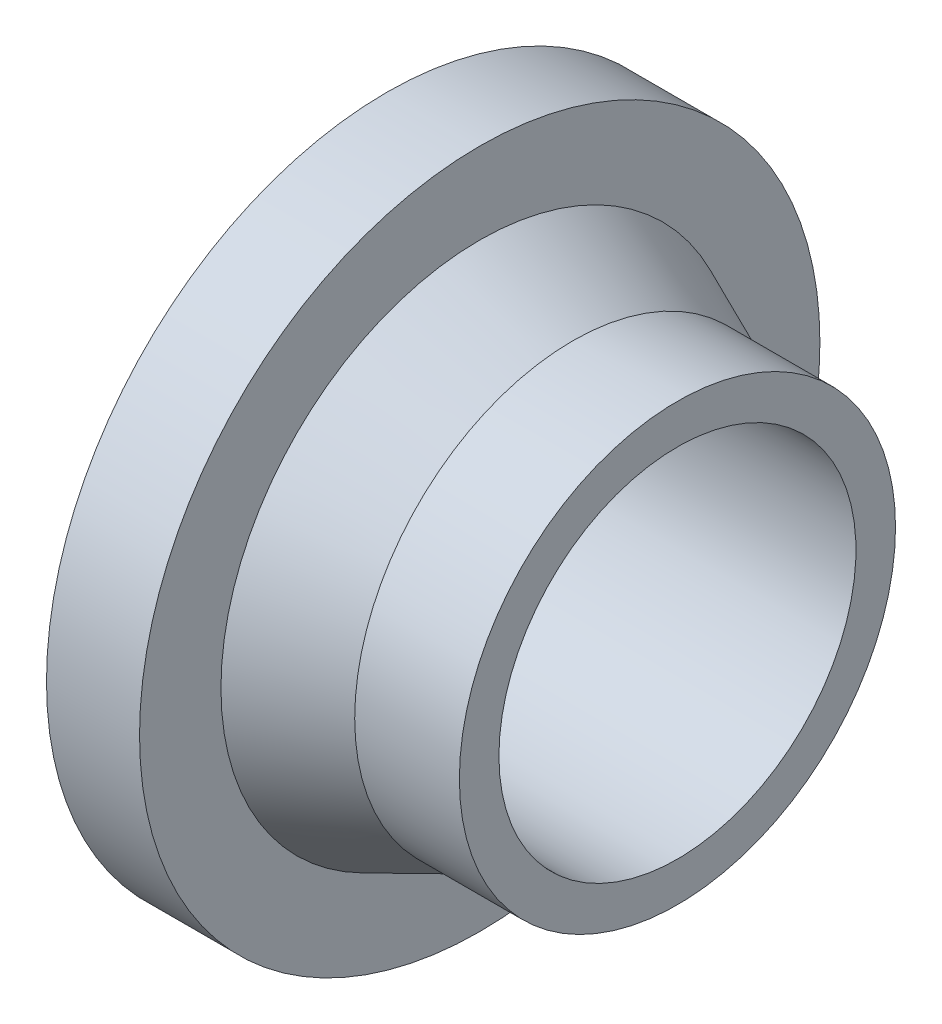
ISO-10303-21;
HEADER;
FILE_DESCRIPTION(('STEP AP214'),'2;1');
FILE_NAME('part.step','',(''),(''),'','','');
FILE_SCHEMA(('AUTOMOTIVE_DESIGN { 1 0 10303 214 1 1 1 1 }'));
ENDSEC;
DATA;
#1=APPLICATION_CONTEXT('core data for automotive mechanical design processes');
#2=APPLICATION_PROTOCOL_DEFINITION('international standard','automotive_design',2000,#1);
#3=PRODUCT_CONTEXT('',#1,'mechanical');
#4=PRODUCT('Part','Part','',(#3));
#5=PRODUCT_RELATED_PRODUCT_CATEGORY('part','',(#4));
#6=PRODUCT_DEFINITION_FORMATION('','',#4);
#7=PRODUCT_DEFINITION_CONTEXT('part definition',#1,'design');
#8=PRODUCT_DEFINITION('design','',#6,#7);
#9=PRODUCT_DEFINITION_SHAPE('','',#8);
#10=(LENGTH_UNIT() NAMED_UNIT(*) SI_UNIT(.MILLI.,.METRE.));
#11=(NAMED_UNIT(*) PLANE_ANGLE_UNIT() SI_UNIT($,.RADIAN.));
#12=(NAMED_UNIT(*) SI_UNIT($,.STERADIAN.) SOLID_ANGLE_UNIT());
#13=UNCERTAINTY_MEASURE_WITH_UNIT(LENGTH_MEASURE(1.E-05),#10,'distance_accuracy_value','');
#14=(GEOMETRIC_REPRESENTATION_CONTEXT(3) GLOBAL_UNCERTAINTY_ASSIGNED_CONTEXT((#13)) GLOBAL_UNIT_ASSIGNED_CONTEXT((#10,
#11,#12)) REPRESENTATION_CONTEXT('',''));
#15=CARTESIAN_POINT('',(0.,0.,0.));
#16=DIRECTION('',(0.,0.,1.));
#17=DIRECTION('',(1.,0.,0.));
#18=AXIS2_PLACEMENT_3D('',#15,#16,#17);
#19=CARTESIAN_POINT('',(-18.,0.,0.));
#20=DIRECTION('',(-1.,0.,0.));
#21=DIRECTION('',(0.,0.,1.));
#22=AXIS2_PLACEMENT_3D('',#19,#20,#21);
#23=CONICAL_SURFACE('',#22,37.5,0.412410441597387);
#24=CARTESIAN_POINT('',(-34.,0.,0.));
#25=DIRECTION('',(-1.,0.,0.));
#26=DIRECTION('',(0.,0.,1.));
#27=AXIS2_PLACEMENT_3D('',#24,#25,#26);
#28=CIRCLE('',#27,44.5);
#29=CARTESIAN_POINT('',(-34.,0.,44.5));
#30=VERTEX_POINT('',#29);
#31=EDGE_CURVE('E16',#30,#30,#28,.T.);
#32=ORIENTED_EDGE('',*,*,#31,.F.);
#33=EDGE_LOOP('',(#32));
#34=FACE_BOUND('',#33,.T.);
#35=CARTESIAN_POINT('',(-18.,0.,0.));
#36=DIRECTION('',(-1.,0.,0.));
#37=DIRECTION('',(0.,1.,0.));
#38=AXIS2_PLACEMENT_3D('',#35,#36,#37);
#39=CIRCLE('',#38,37.5);
#40=CARTESIAN_POINT('',(-18.,37.5,0.));
#41=VERTEX_POINT('',#40);
#42=EDGE_CURVE('E28',#41,#41,#39,.F.);
#43=ORIENTED_EDGE('',*,*,#42,.F.);
#44=EDGE_LOOP('',(#43));
#45=FACE_BOUND('',#44,.T.);
#46=ADVANCED_FACE('F13',(#34,#45),#23,.T.);
#47=CARTESIAN_POINT('',(-34.,58.5,59.2020021081185));
#48=DIRECTION('',(1.,0.,0.));
#49=DIRECTION('',(0.,-1.,0.));
#50=AXIS2_PLACEMENT_3D('',#47,#48,#49);
#51=PLANE('',#50);
#52=ORIENTED_EDGE('',*,*,#31,.T.);
#53=EDGE_LOOP('',(#52));
#54=FACE_BOUND('',#53,.T.);
#55=CARTESIAN_POINT('',(-34.,0.,0.));
#56=DIRECTION('',(-1.,0.,0.));
#57=DIRECTION('',(0.,0.,1.));
#58=AXIS2_PLACEMENT_3D('',#55,#56,#57);
#59=CIRCLE('',#58,58.5);
#60=CARTESIAN_POINT('',(-34.,0.,58.5));
#61=VERTEX_POINT('',#60);
#62=EDGE_CURVE('E34',#61,#61,#59,.T.);
#63=ORIENTED_EDGE('',*,*,#62,.F.);
#64=EDGE_LOOP('',(#63));
#65=FACE_BOUND('',#64,.T.);
#66=ADVANCED_FACE('F44',(#54,#65),#51,.T.);
#67=CARTESIAN_POINT('',(-18.,0.,0.));
#68=DIRECTION('',(-1.,0.,0.));
#69=DIRECTION('',(0.,0.,1.));
#70=AXIS2_PLACEMENT_3D('',#67,#68,#69);
#71=CYLINDRICAL_SURFACE('',#70,37.5);
#72=ORIENTED_EDGE('',*,*,#42,.T.);
#73=EDGE_LOOP('',(#72));
#74=FACE_BOUND('',#73,.T.);
#75=CARTESIAN_POINT('',(0.,0.,0.));
#76=DIRECTION('',(-1.,0.,0.));
#77=DIRECTION('',(0.,0.,1.));
#78=AXIS2_PLACEMENT_3D('',#75,#76,#77);
#79=CIRCLE('',#78,37.5);
#80=CARTESIAN_POINT('',(0.,0.,37.5));
#81=VERTEX_POINT('',#80);
#82=EDGE_CURVE('E32',#81,#81,#79,.F.);
#83=ORIENTED_EDGE('',*,*,#82,.F.);
#84=EDGE_LOOP('',(#83));
#85=FACE_BOUND('',#84,.T.);
#86=ADVANCED_FACE('F53',(#74,#85),#71,.T.);
#87=CARTESIAN_POINT('',(-50.,0.,0.));
#88=DIRECTION('',(-1.,0.,0.));
#89=DIRECTION('',(0.,0.,1.));
#90=AXIS2_PLACEMENT_3D('',#87,#88,#89);
#91=CYLINDRICAL_SURFACE('',#90,58.5);
#92=CARTESIAN_POINT('',(-50.,0.,0.));
#93=DIRECTION('',(-1.,0.,0.));
#94=DIRECTION('',(0.,0.,1.));
#95=AXIS2_PLACEMENT_3D('',#92,#93,#94);
#96=CIRCLE('',#95,58.5);
#97=CARTESIAN_POINT('',(-50.,0.,58.5));
#98=VERTEX_POINT('',#97);
#99=EDGE_CURVE('E25',#98,#98,#96,.T.);
#100=ORIENTED_EDGE('',*,*,#99,.F.);
#101=EDGE_LOOP('',(#100));
#102=FACE_BOUND('',#101,.T.);
#103=ORIENTED_EDGE('',*,*,#62,.T.);
#104=EDGE_LOOP('',(#103));
#105=FACE_BOUND('',#104,.T.);
#106=ADVANCED_FACE('F68',(#102,#105),#91,.T.);
#107=CARTESIAN_POINT('',(0.,37.5,37.9500021082962));
#108=DIRECTION('',(1.,0.,0.));
#109=DIRECTION('',(0.,-1.,0.));
#110=AXIS2_PLACEMENT_3D('',#107,#108,#109);
#111=PLANE('',#110);
#112=CARTESIAN_POINT('',(0.,0.,0.));
#113=DIRECTION('',(-1.,0.,0.));
#114=DIRECTION('',(0.,0.,1.));
#115=AXIS2_PLACEMENT_3D('',#112,#113,#114);
#116=CIRCLE('',#115,30.7);
#117=CARTESIAN_POINT('',(0.,0.,30.7));
#118=VERTEX_POINT('',#117);
#119=EDGE_CURVE('E20',#118,#118,#116,.F.);
#120=ORIENTED_EDGE('',*,*,#119,.F.);
#121=EDGE_LOOP('',(#120));
#122=FACE_BOUND('',#121,.T.);
#123=ORIENTED_EDGE('',*,*,#82,.T.);
#124=EDGE_LOOP('',(#123));
#125=FACE_BOUND('',#124,.T.);
#126=ADVANCED_FACE('F62',(#122,#125),#111,.T.);
#127=CARTESIAN_POINT('',(-50.,-58.5,59.2020021083088));
#128=DIRECTION('',(-1.,0.,0.));
#129=DIRECTION('',(0.,1.,0.));
#130=AXIS2_PLACEMENT_3D('',#127,#128,#129);
#131=PLANE('',#130);
#132=CARTESIAN_POINT('',(-50.,0.,0.));
#133=DIRECTION('',(-1.,0.,0.));
#134=DIRECTION('',(0.,0.,1.));
#135=AXIS2_PLACEMENT_3D('',#132,#133,#134);
#136=CIRCLE('',#135,30.7);
#137=CARTESIAN_POINT('',(-50.,0.,30.7));
#138=VERTEX_POINT('',#137);
#139=EDGE_CURVE('E8',#138,#138,#136,.T.);
#140=ORIENTED_EDGE('',*,*,#139,.F.);
#141=EDGE_LOOP('',(#140));
#142=FACE_BOUND('',#141,.T.);
#143=ORIENTED_EDGE('',*,*,#99,.T.);
#144=EDGE_LOOP('',(#143));
#145=FACE_BOUND('',#144,.T.);
#146=ADVANCED_FACE('F56',(#142,#145),#131,.T.);
#147=CARTESIAN_POINT('',(0.,0.,0.));
#148=DIRECTION('',(-1.,0.,0.));
#149=DIRECTION('',(0.,0.,1.));
#150=AXIS2_PLACEMENT_3D('',#147,#148,#149);
#151=CYLINDRICAL_SURFACE('',#150,30.7);
#152=ORIENTED_EDGE('',*,*,#119,.T.);
#153=EDGE_LOOP('',(#152));
#154=FACE_BOUND('',#153,.T.);
#155=ORIENTED_EDGE('',*,*,#139,.T.);
#156=EDGE_LOOP('',(#155));
#157=FACE_BOUND('',#156,.T.);
#158=ADVANCED_FACE('F54',(#154,#157),#151,.F.);
#159=CLOSED_SHELL('',(#46,#66,#86,#106,#126,#146,#158));
#160=MANIFOLD_SOLID_BREP('B1',#159);
#161=ADVANCED_BREP_SHAPE_REPRESENTATION('',(#18,#160),#14);
#162=SHAPE_DEFINITION_REPRESENTATION(#9,#161);
ENDSEC;
END-ISO-10303-21;
